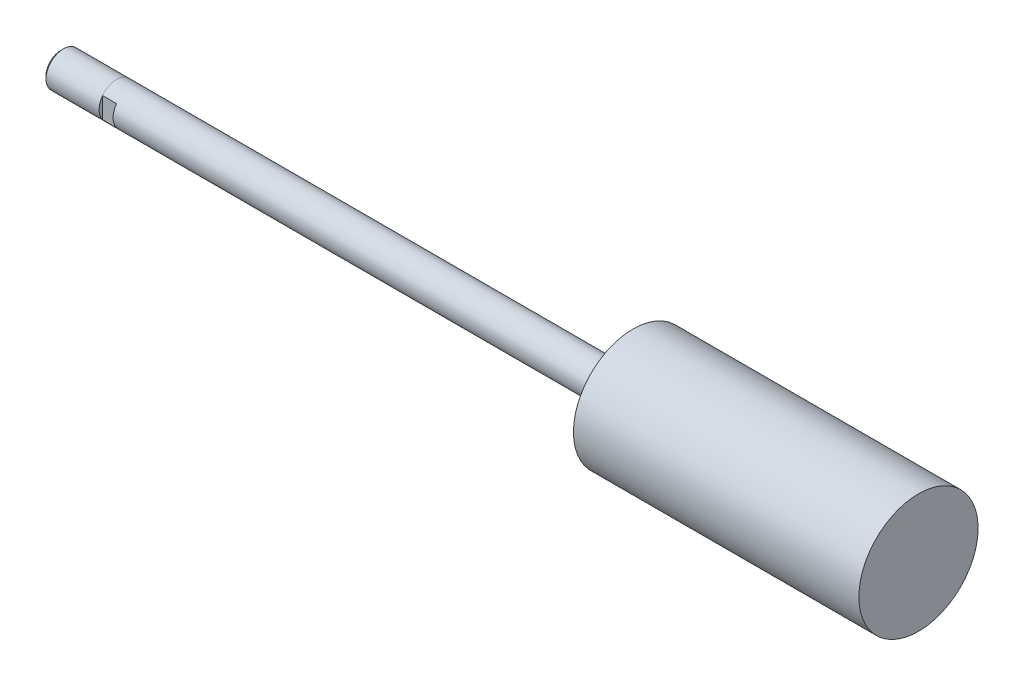
ISO-10303-21;
HEADER;
FILE_DESCRIPTION(('STEP AP214'),'2;1');
FILE_NAME('part.step','',(''),(''),'','','');
FILE_SCHEMA(('AUTOMOTIVE_DESIGN { 1 0 10303 214 1 1 1 1 }'));
ENDSEC;
DATA;
#1=APPLICATION_CONTEXT('core data for automotive mechanical design processes');
#2=APPLICATION_PROTOCOL_DEFINITION('international standard','automotive_design',2000,#1);
#3=PRODUCT_CONTEXT('',#1,'mechanical');
#4=PRODUCT('Part','Part','',(#3));
#5=PRODUCT_RELATED_PRODUCT_CATEGORY('part','',(#4));
#6=PRODUCT_DEFINITION_FORMATION('','',#4);
#7=PRODUCT_DEFINITION_CONTEXT('part definition',#1,'design');
#8=PRODUCT_DEFINITION('design','',#6,#7);
#9=PRODUCT_DEFINITION_SHAPE('','',#8);
#10=(LENGTH_UNIT() NAMED_UNIT(*) SI_UNIT(.MILLI.,.METRE.));
#11=(NAMED_UNIT(*) PLANE_ANGLE_UNIT() SI_UNIT($,.RADIAN.));
#12=(NAMED_UNIT(*) SI_UNIT($,.STERADIAN.) SOLID_ANGLE_UNIT());
#13=UNCERTAINTY_MEASURE_WITH_UNIT(LENGTH_MEASURE(1.E-05),#10,'distance_accuracy_value','');
#14=(GEOMETRIC_REPRESENTATION_CONTEXT(3) GLOBAL_UNCERTAINTY_ASSIGNED_CONTEXT((#13)) GLOBAL_UNIT_ASSIGNED_CONTEXT((#10,
#11,#12)) REPRESENTATION_CONTEXT('',''));
#15=CARTESIAN_POINT('',(0.,0.,0.));
#16=DIRECTION('',(0.,0.,1.));
#17=DIRECTION('',(1.,0.,0.));
#18=AXIS2_PLACEMENT_3D('',#15,#16,#17);
#19=CARTESIAN_POINT('',(179.2224,0.,0.));
#20=DIRECTION('',(-1.,0.,0.));
#21=DIRECTION('',(0.,0.,1.));
#22=AXIS2_PLACEMENT_3D('',#19,#20,#21);
#23=CYLINDRICAL_SURFACE('',#22,3.9624);
#24=DIRECTION('',(-1.,0.,0.));
#25=VECTOR('',#24,1.);
#26=CARTESIAN_POINT('',(179.2224,2.37065154757084,-3.175));
#27=LINE('',#26,#25);
#28=CARTESIAN_POINT('',(0.,2.37065154757084,-3.175));
#29=VERTEX_POINT('',#28);
#30=CARTESIAN_POINT('',(-3.175,2.37595077378542,-3.175));
#31=VERTEX_POINT('',#30);
#32=EDGE_CURVE('E101',#29,#31,#27,.T.);
#33=ORIENTED_EDGE('',*,*,#32,.T.);
#34=CARTESIAN_POINT('',(-3.175,0.,0.));
#35=DIRECTION('',(-1.,0.,0.));
#36=DIRECTION('',(0.,0.599143734238293,0.800641483888384));
#37=AXIS2_PLACEMENT_3D('',#34,#35,#36);
#38=CIRCLE('',#37,3.96875);
#39=CARTESIAN_POINT('',(-3.17500000000001,2.37594941390202,3.17500385247068));
#40=VERTEX_POINT('',#39);
#41=EDGE_CURVE('E81',#40,#31,#38,.T.);
#42=ORIENTED_EDGE('',*,*,#41,.F.);
#43=DIRECTION('',(-1.,0.,0.));
#44=VECTOR('',#43,1.);
#45=CARTESIAN_POINT('',(179.2224,2.37065154757084,3.175));
#46=LINE('',#45,#44);
#47=CARTESIAN_POINT('',(0.,2.37065154757084,3.175));
#48=VERTEX_POINT('',#47);
#49=EDGE_CURVE('E110',#40,#48,#46,.F.);
#50=ORIENTED_EDGE('',*,*,#49,.T.);
#51=CARTESIAN_POINT('',(0.,0.,0.));
#52=DIRECTION('',(1.,0.,0.));
#53=DIRECTION('',(0.,0.,-1.));
#54=AXIS2_PLACEMENT_3D('',#51,#52,#53);
#55=CIRCLE('',#54,3.9624);
#56=CARTESIAN_POINT('',(0.,-2.37065154757084,3.175));
#57=VERTEX_POINT('',#56);
#58=EDGE_CURVE('E11',#48,#57,#55,.T.);
#59=ORIENTED_EDGE('',*,*,#58,.T.);
#60=DIRECTION('',(-1.,0.,0.));
#61=VECTOR('',#60,1.);
#62=CARTESIAN_POINT('',(179.2224,-2.37065154757084,3.175));
#63=LINE('',#62,#61);
#64=CARTESIAN_POINT('',(-3.175,-2.37595077378542,3.175));
#65=VERTEX_POINT('',#64);
#66=EDGE_CURVE('E112',#57,#65,#63,.T.);
#67=ORIENTED_EDGE('',*,*,#66,.T.);
#68=CARTESIAN_POINT('',(-3.175,0.,0.));
#69=DIRECTION('',(-1.,0.,0.));
#70=DIRECTION('',(0.,-0.599143734238397,-0.800641483888306));
#71=AXIS2_PLACEMENT_3D('',#68,#69,#70);
#72=CIRCLE('',#71,3.96875);
#73=CARTESIAN_POINT('',(-3.17500000000002,-2.37594941390243,-3.17500385247037));
#74=VERTEX_POINT('',#73);
#75=EDGE_CURVE('E95',#74,#65,#72,.T.);
#76=ORIENTED_EDGE('',*,*,#75,.F.);
#77=DIRECTION('',(-1.,0.,0.));
#78=VECTOR('',#77,1.);
#79=CARTESIAN_POINT('',(179.2224,-2.37065154757084,-3.175));
#80=LINE('',#79,#78);
#81=CARTESIAN_POINT('',(0.,-2.37065154757084,-3.175));
#82=VERTEX_POINT('',#81);
#83=EDGE_CURVE('E104',#74,#82,#80,.F.);
#84=ORIENTED_EDGE('',*,*,#83,.T.);
#85=EDGE_CURVE('E41',#82,#29,#55,.T.);
#86=ORIENTED_EDGE('',*,*,#85,.T.);
#87=EDGE_LOOP('',(#33,#42,#50,#59,#67,#76,#84,#86));
#88=FACE_BOUND('',#87,.T.);
#89=CARTESIAN_POINT('',(114.3,0.,0.));
#90=DIRECTION('',(-1.,0.,0.));
#91=DIRECTION('',(0.,0.,1.));
#92=AXIS2_PLACEMENT_3D('',#89,#90,#91);
#93=CIRCLE('',#92,3.9624);
#94=CARTESIAN_POINT('',(114.3,0.,3.9624));
#95=VERTEX_POINT('',#94);
#96=EDGE_CURVE('E200',#95,#95,#93,.T.);
#97=ORIENTED_EDGE('',*,*,#96,.T.);
#98=EDGE_LOOP('',(#97));
#99=FACE_BOUND('',#98,.T.);
#100=ADVANCED_FACE('F37',(#88,#99),#23,.T.);
#101=CARTESIAN_POINT('',(114.3,3.9624,0.));
#102=DIRECTION('',(1.,0.,0.));
#103=DIRECTION('',(0.,0.,-1.));
#104=AXIS2_PLACEMENT_3D('',#101,#102,#103);
#105=PLANE('',#104);
#106=ORIENTED_EDGE('',*,*,#96,.F.);
#107=EDGE_LOOP('',(#106));
#108=FACE_BOUND('',#107,.T.);
#109=CARTESIAN_POINT('',(114.3,0.,0.));
#110=DIRECTION('',(-1.,0.,0.));
#111=DIRECTION('',(0.,0.,1.));
#112=AXIS2_PLACEMENT_3D('',#109,#110,#111);
#113=CIRCLE('',#112,13.55725);
#114=CARTESIAN_POINT('',(114.3,0.,13.55725));
#115=VERTEX_POINT('',#114);
#116=EDGE_CURVE('E202',#115,#115,#113,.T.);
#117=ORIENTED_EDGE('',*,*,#116,.T.);
#118=EDGE_LOOP('',(#117));
#119=FACE_BOUND('',#118,.T.);
#120=ADVANCED_FACE('F220',(#108,#119),#105,.F.);
#121=CARTESIAN_POINT('',(179.2224,0.,0.));
#122=DIRECTION('',(-1.,0.,0.));
#123=DIRECTION('',(0.,0.,1.));
#124=AXIS2_PLACEMENT_3D('',#121,#122,#123);
#125=CYLINDRICAL_SURFACE('',#124,13.55725);
#126=ORIENTED_EDGE('',*,*,#116,.F.);
#127=EDGE_LOOP('',(#126));
#128=FACE_BOUND('',#127,.T.);
#129=CARTESIAN_POINT('',(179.2224,0.,0.));
#130=DIRECTION('',(-1.,0.,0.));
#131=DIRECTION('',(0.,0.,1.));
#132=AXIS2_PLACEMENT_3D('',#129,#130,#131);
#133=CIRCLE('',#132,13.55725);
#134=CARTESIAN_POINT('',(179.2224,0.,13.55725));
#135=VERTEX_POINT('',#134);
#136=EDGE_CURVE('E145',#135,#135,#133,.T.);
#137=ORIENTED_EDGE('',*,*,#136,.T.);
#138=EDGE_LOOP('',(#137));
#139=FACE_BOUND('',#138,.T.);
#140=ADVANCED_FACE('F209',(#128,#139),#125,.T.);
#141=CARTESIAN_POINT('',(179.2224,13.55725,0.));
#142=DIRECTION('',(-1.,0.,0.));
#143=DIRECTION('',(0.,0.,1.));
#144=AXIS2_PLACEMENT_3D('',#141,#142,#143);
#145=PLANE('',#144);
#146=ORIENTED_EDGE('',*,*,#136,.F.);
#147=EDGE_LOOP('',(#146));
#148=FACE_BOUND('',#147,.T.);
#149=ADVANCED_FACE('F211',(#148),#145,.F.);
#150=CARTESIAN_POINT('',(-15.875,0.,0.));
#151=DIRECTION('',(1.,0.,0.));
#152=DIRECTION('',(0.,0.,-1.));
#153=AXIS2_PLACEMENT_3D('',#150,#151,#152);
#154=PLANE('',#153);
#155=CARTESIAN_POINT('',(-15.875,0.,0.));
#156=DIRECTION('',(-1.,0.,0.));
#157=DIRECTION('',(0.,0.,1.));
#158=AXIS2_PLACEMENT_3D('',#155,#156,#157);
#159=CIRCLE('',#158,3.33883);
#160=CARTESIAN_POINT('',(-15.875,0.,3.33883));
#161=VERTEX_POINT('',#160);
#162=EDGE_CURVE('E138',#161,#161,#159,.T.);
#163=ORIENTED_EDGE('',*,*,#162,.T.);
#164=EDGE_LOOP('',(#163));
#165=FACE_BOUND('',#164,.T.);
#166=ADVANCED_FACE('F213',(#165),#154,.F.);
#167=CARTESIAN_POINT('',(-15.24508,0.,0.));
#168=DIRECTION('',(1.,0.,0.));
#169=DIRECTION('',(0.,0.,-1.));
#170=AXIS2_PLACEMENT_3D('',#167,#168,#169);
#171=CONICAL_SURFACE('',#170,3.96875,0.785398163397449);
#172=ORIENTED_EDGE('',*,*,#162,.F.);
#173=EDGE_LOOP('',(#172));
#174=FACE_BOUND('',#173,.T.);
#175=CARTESIAN_POINT('',(-15.24508,0.,0.));
#176=DIRECTION('',(-1.,0.,0.));
#177=DIRECTION('',(0.,0.,1.));
#178=AXIS2_PLACEMENT_3D('',#175,#176,#177);
#179=CIRCLE('',#178,3.96875);
#180=CARTESIAN_POINT('',(-15.24508,0.,3.96875));
#181=VERTEX_POINT('',#180);
#182=EDGE_CURVE('E135',#181,#181,#179,.T.);
#183=ORIENTED_EDGE('',*,*,#182,.T.);
#184=EDGE_LOOP('',(#183));
#185=FACE_BOUND('',#184,.T.);
#186=ADVANCED_FACE('F173',(#174,#185),#171,.T.);
#187=CARTESIAN_POINT('',(-3.175,0.,0.));
#188=DIRECTION('',(-1.,0.,0.));
#189=DIRECTION('',(0.,0.,1.));
#190=AXIS2_PLACEMENT_3D('',#187,#188,#189);
#191=CYLINDRICAL_SURFACE('',#190,3.96875);
#192=ORIENTED_EDGE('',*,*,#182,.F.);
#193=EDGE_LOOP('',(#192));
#194=FACE_BOUND('',#193,.T.);
#195=ORIENTED_EDGE('',*,*,#41,.T.);
#196=CARTESIAN_POINT('',(-3.175,0.,0.));
#197=DIRECTION('',(-1.,0.,0.));
#198=DIRECTION('',(0.,0.599143734238395,-0.800641483888308));
#199=AXIS2_PLACEMENT_3D('',#196,#197,#198);
#200=CIRCLE('',#199,3.96875);
#201=EDGE_CURVE('E84',#31,#74,#200,.T.);
#202=ORIENTED_EDGE('',*,*,#201,.T.);
#203=ORIENTED_EDGE('',*,*,#75,.T.);
#204=CARTESIAN_POINT('',(-3.175,0.,0.));
#205=DIRECTION('',(-1.,0.,0.));
#206=DIRECTION('',(0.,-0.599143734238393,0.800641483888309));
#207=AXIS2_PLACEMENT_3D('',#204,#205,#206);
#208=CIRCLE('',#207,3.96875);
#209=EDGE_CURVE('E86',#65,#40,#208,.T.);
#210=ORIENTED_EDGE('',*,*,#209,.T.);
#211=EDGE_LOOP('',(#195,#202,#203,#210));
#212=FACE_BOUND('',#211,.T.);
#213=ADVANCED_FACE('F83',(#194,#212),#191,.T.);
#214=CARTESIAN_POINT('',(-3.175,0.,0.));
#215=DIRECTION('',(1.,0.,0.));
#216=DIRECTION('',(0.,0.,-1.));
#217=AXIS2_PLACEMENT_3D('',#214,#215,#216);
#218=PLANE('',#217);
#219=ORIENTED_EDGE('',*,*,#201,.F.);
#220=DIRECTION('',(0.,1.,0.));
#221=VECTOR('',#220,1.);
#222=CARTESIAN_POINT('',(-3.175,-3.9624,-3.175));
#223=LINE('',#222,#221);
#224=EDGE_CURVE('E51',#74,#31,#223,.T.);
#225=ORIENTED_EDGE('',*,*,#224,.F.);
#226=EDGE_LOOP('',(#219,#225));
#227=FACE_BOUND('',#226,.T.);
#228=ADVANCED_FACE('F94',(#227),#218,.T.);
#229=CARTESIAN_POINT('',(0.,-3.9624,-3.175));
#230=DIRECTION('',(0.,0.,1.));
#231=DIRECTION('',(1.,0.,0.));
#232=AXIS2_PLACEMENT_3D('',#229,#230,#231);
#233=PLANE('',#232);
#234=DIRECTION('',(0.,1.,0.));
#235=VECTOR('',#234,1.);
#236=CARTESIAN_POINT('',(0.,-3.9624,-3.175));
#237=LINE('',#236,#235);
#238=EDGE_CURVE('E114',#82,#29,#237,.T.);
#239=ORIENTED_EDGE('',*,*,#238,.F.);
#240=ORIENTED_EDGE('',*,*,#83,.F.);
#241=ORIENTED_EDGE('',*,*,#224,.T.);
#242=ORIENTED_EDGE('',*,*,#32,.F.);
#243=EDGE_LOOP('',(#239,#240,#241,#242));
#244=FACE_BOUND('',#243,.T.);
#245=ADVANCED_FACE('F100',(#244),#233,.F.);
#246=CARTESIAN_POINT('',(0.,0.,0.));
#247=DIRECTION('',(1.,0.,0.));
#248=DIRECTION('',(0.,0.,-1.));
#249=AXIS2_PLACEMENT_3D('',#246,#247,#248);
#250=PLANE('',#249);
#251=ORIENTED_EDGE('',*,*,#238,.T.);
#252=ORIENTED_EDGE('',*,*,#85,.F.);
#253=EDGE_LOOP('',(#251,#252));
#254=FACE_BOUND('',#253,.T.);
#255=ADVANCED_FACE('F261',(#254),#250,.F.);
#256=DIRECTION('',(0.,-1.,0.));
#257=VECTOR('',#256,1.);
#258=CARTESIAN_POINT('',(0.,3.9624,3.175));
#259=LINE('',#258,#257);
#260=EDGE_CURVE('E106',#48,#57,#259,.T.);
#261=ORIENTED_EDGE('',*,*,#260,.T.);
#262=ORIENTED_EDGE('',*,*,#58,.F.);
#263=EDGE_LOOP('',(#261,#262));
#264=FACE_BOUND('',#263,.T.);
#265=ADVANCED_FACE('F131',(#264),#250,.F.);
#266=ORIENTED_EDGE('',*,*,#209,.F.);
#267=DIRECTION('',(0.,-1.,0.));
#268=VECTOR('',#267,1.);
#269=CARTESIAN_POINT('',(-3.175,3.9624,3.175));
#270=LINE('',#269,#268);
#271=EDGE_CURVE('E58',#40,#65,#270,.T.);
#272=ORIENTED_EDGE('',*,*,#271,.F.);
#273=EDGE_LOOP('',(#266,#272));
#274=FACE_BOUND('',#273,.T.);
#275=ADVANCED_FACE('F151',(#274),#218,.T.);
#276=CARTESIAN_POINT('',(0.,3.9624,3.175));
#277=DIRECTION('',(0.,0.,-1.));
#278=DIRECTION('',(-1.,0.,0.));
#279=AXIS2_PLACEMENT_3D('',#276,#277,#278);
#280=PLANE('',#279);
#281=ORIENTED_EDGE('',*,*,#260,.F.);
#282=ORIENTED_EDGE('',*,*,#49,.F.);
#283=ORIENTED_EDGE('',*,*,#271,.T.);
#284=ORIENTED_EDGE('',*,*,#66,.F.);
#285=EDGE_LOOP('',(#281,#282,#283,#284));
#286=FACE_BOUND('',#285,.T.);
#287=ADVANCED_FACE('F134',(#286),#280,.F.);
#288=CLOSED_SHELL('',(#100,#120,#140,#149,#166,#186,#213,#228,#245,#255,#265,#275,#287));
#289=MANIFOLD_SOLID_BREP('B2',#288);
#290=ADVANCED_BREP_SHAPE_REPRESENTATION('',(#18,#289),#14);
#291=SHAPE_DEFINITION_REPRESENTATION(#9,#290);
ENDSEC;
END-ISO-10303-21;
